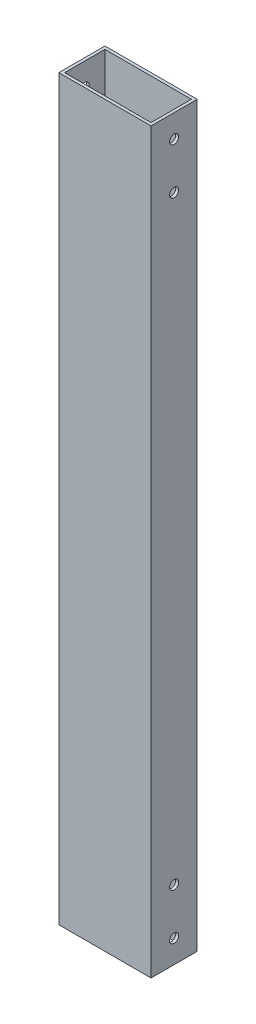
ISO-10303-21;
HEADER;
FILE_DESCRIPTION(('STEP AP214'),'2;1');
FILE_NAME('part.step','',(''),(''),'','','');
FILE_SCHEMA(('AUTOMOTIVE_DESIGN { 1 0 10303 214 1 1 1 1 }'));
ENDSEC;
DATA;
#1=APPLICATION_CONTEXT('core data for automotive mechanical design processes');
#2=APPLICATION_PROTOCOL_DEFINITION('international standard','automotive_design',2000,#1);
#3=PRODUCT_CONTEXT('',#1,'mechanical');
#4=PRODUCT('Part','Part','',(#3));
#5=PRODUCT_RELATED_PRODUCT_CATEGORY('part','',(#4));
#6=PRODUCT_DEFINITION_FORMATION('','',#4);
#7=PRODUCT_DEFINITION_CONTEXT('part definition',#1,'design');
#8=PRODUCT_DEFINITION('design','',#6,#7);
#9=PRODUCT_DEFINITION_SHAPE('','',#8);
#10=(LENGTH_UNIT() NAMED_UNIT(*) SI_UNIT(.MILLI.,.METRE.));
#11=(NAMED_UNIT(*) PLANE_ANGLE_UNIT() SI_UNIT($,.RADIAN.));
#12=(NAMED_UNIT(*) SI_UNIT($,.STERADIAN.) SOLID_ANGLE_UNIT());
#13=UNCERTAINTY_MEASURE_WITH_UNIT(LENGTH_MEASURE(1.E-05),#10,'distance_accuracy_value','');
#14=(GEOMETRIC_REPRESENTATION_CONTEXT(3) GLOBAL_UNCERTAINTY_ASSIGNED_CONTEXT((#13)) GLOBAL_UNIT_ASSIGNED_CONTEXT((#10,
#11,#12)) REPRESENTATION_CONTEXT('',''));
#15=CARTESIAN_POINT('',(0.,0.,0.));
#16=DIRECTION('',(0.,0.,1.));
#17=DIRECTION('',(1.,0.,0.));
#18=AXIS2_PLACEMENT_3D('',#15,#16,#17);
#19=CARTESIAN_POINT('',(0.,12.7,-12.7));
#20=DIRECTION('',(1.,0.,0.));
#21=DIRECTION('',(0.,0.,-1.));
#22=AXIS2_PLACEMENT_3D('',#19,#20,#21);
#23=CYLINDRICAL_SURFACE('',#22,2.4892);
#24=CARTESIAN_POINT('',(1.5875,12.7,-12.7));
#25=DIRECTION('',(-1.,0.,0.));
#26=DIRECTION('',(0.,0.,-1.));
#27=AXIS2_PLACEMENT_3D('',#24,#25,#26);
#28=CIRCLE('',#27,2.4892);
#29=CARTESIAN_POINT('',(1.5875,12.7,-15.1892));
#30=VERTEX_POINT('',#29);
#31=EDGE_CURVE('E217',#30,#30,#28,.T.);
#32=ORIENTED_EDGE('',*,*,#31,.F.);
#33=EDGE_LOOP('',(#32));
#34=FACE_BOUND('',#33,.T.);
#35=CARTESIAN_POINT('',(0.,12.7,-12.7));
#36=DIRECTION('',(-1.,0.,0.));
#37=DIRECTION('',(0.,0.,-1.));
#38=AXIS2_PLACEMENT_3D('',#35,#36,#37);
#39=CIRCLE('',#38,2.4892);
#40=CARTESIAN_POINT('',(0.,12.7,-15.1892));
#41=VERTEX_POINT('',#40);
#42=EDGE_CURVE('E258',#41,#41,#39,.T.);
#43=ORIENTED_EDGE('',*,*,#42,.T.);
#44=EDGE_LOOP('',(#43));
#45=FACE_BOUND('',#44,.T.);
#46=ADVANCED_FACE('F16',(#34,#45),#23,.F.);
#47=CARTESIAN_POINT('',(0.,38.1,-12.7));
#48=DIRECTION('',(1.,0.,0.));
#49=DIRECTION('',(0.,0.,-1.));
#50=AXIS2_PLACEMENT_3D('',#47,#48,#49);
#51=CYLINDRICAL_SURFACE('',#50,2.4892);
#52=CARTESIAN_POINT('',(1.5875,38.1,-12.7));
#53=DIRECTION('',(-1.,0.,0.));
#54=DIRECTION('',(0.,0.,-1.));
#55=AXIS2_PLACEMENT_3D('',#52,#53,#54);
#56=CIRCLE('',#55,2.4892);
#57=CARTESIAN_POINT('',(1.5875,38.1,-15.1892));
#58=VERTEX_POINT('',#57);
#59=EDGE_CURVE('E220',#58,#58,#56,.T.);
#60=ORIENTED_EDGE('',*,*,#59,.F.);
#61=EDGE_LOOP('',(#60));
#62=FACE_BOUND('',#61,.T.);
#63=CARTESIAN_POINT('',(0.,38.1,-12.7));
#64=DIRECTION('',(-1.,0.,0.));
#65=DIRECTION('',(0.,0.,-1.));
#66=AXIS2_PLACEMENT_3D('',#63,#64,#65);
#67=CIRCLE('',#66,2.4892);
#68=CARTESIAN_POINT('',(0.,38.1,-15.1892));
#69=VERTEX_POINT('',#68);
#70=EDGE_CURVE('E216',#69,#69,#67,.T.);
#71=ORIENTED_EDGE('',*,*,#70,.T.);
#72=EDGE_LOOP('',(#71));
#73=FACE_BOUND('',#72,.T.);
#74=ADVANCED_FACE('F481',(#62,#73),#51,.F.);
#75=CARTESIAN_POINT('',(0.,12.7,-12.7));
#76=DIRECTION('',(1.,0.,0.));
#77=DIRECTION('',(0.,0.,-1.));
#78=AXIS2_PLACEMENT_3D('',#75,#76,#77);
#79=CYLINDRICAL_SURFACE('',#78,2.4892);
#80=CARTESIAN_POINT('',(49.2125,12.7,-12.7));
#81=DIRECTION('',(1.,0.,0.));
#82=DIRECTION('',(0.,0.,1.));
#83=AXIS2_PLACEMENT_3D('',#80,#81,#82);
#84=CIRCLE('',#83,2.4892);
#85=CARTESIAN_POINT('',(49.2125,12.7,-10.2108));
#86=VERTEX_POINT('',#85);
#87=EDGE_CURVE('E282',#86,#86,#84,.T.);
#88=ORIENTED_EDGE('',*,*,#87,.F.);
#89=EDGE_LOOP('',(#88));
#90=FACE_BOUND('',#89,.T.);
#91=CARTESIAN_POINT('',(50.8,12.7,-12.7));
#92=DIRECTION('',(-1.,0.,0.));
#93=DIRECTION('',(0.,0.,-1.));
#94=AXIS2_PLACEMENT_3D('',#91,#92,#93);
#95=CIRCLE('',#94,2.4892);
#96=CARTESIAN_POINT('',(50.8,12.7,-15.1892));
#97=VERTEX_POINT('',#96);
#98=EDGE_CURVE('E191',#97,#97,#95,.T.);
#99=ORIENTED_EDGE('',*,*,#98,.F.);
#100=EDGE_LOOP('',(#99));
#101=FACE_BOUND('',#100,.T.);
#102=ADVANCED_FACE('F475',(#90,#101),#79,.F.);
#103=CARTESIAN_POINT('',(0.,38.1,-12.7));
#104=DIRECTION('',(1.,0.,0.));
#105=DIRECTION('',(0.,0.,-1.));
#106=AXIS2_PLACEMENT_3D('',#103,#104,#105);
#107=CYLINDRICAL_SURFACE('',#106,2.4892);
#108=CARTESIAN_POINT('',(49.2125,38.1,-12.7));
#109=DIRECTION('',(1.,0.,0.));
#110=DIRECTION('',(0.,0.,1.));
#111=AXIS2_PLACEMENT_3D('',#108,#109,#110);
#112=CIRCLE('',#111,2.4892);
#113=CARTESIAN_POINT('',(49.2125,38.1,-10.2108));
#114=VERTEX_POINT('',#113);
#115=EDGE_CURVE('E265',#114,#114,#112,.T.);
#116=ORIENTED_EDGE('',*,*,#115,.F.);
#117=EDGE_LOOP('',(#116));
#118=FACE_BOUND('',#117,.T.);
#119=CARTESIAN_POINT('',(50.8,38.1,-12.7));
#120=DIRECTION('',(-1.,0.,0.));
#121=DIRECTION('',(0.,0.,-1.));
#122=AXIS2_PLACEMENT_3D('',#119,#120,#121);
#123=CIRCLE('',#122,2.4892);
#124=CARTESIAN_POINT('',(50.8,38.1,-15.1892));
#125=VERTEX_POINT('',#124);
#126=EDGE_CURVE('E196',#125,#125,#123,.T.);
#127=ORIENTED_EDGE('',*,*,#126,.F.);
#128=EDGE_LOOP('',(#127));
#129=FACE_BOUND('',#128,.T.);
#130=ADVANCED_FACE('F470',(#118,#129),#107,.F.);
#131=CARTESIAN_POINT('',(0.,393.7,-12.7));
#132=DIRECTION('',(1.,0.,0.));
#133=DIRECTION('',(0.,0.,-1.));
#134=AXIS2_PLACEMENT_3D('',#131,#132,#133);
#135=CYLINDRICAL_SURFACE('',#134,2.4892);
#136=CARTESIAN_POINT('',(1.5875,393.7,-12.7));
#137=DIRECTION('',(1.,0.,0.));
#138=DIRECTION('',(0.,0.,-1.));
#139=AXIS2_PLACEMENT_3D('',#136,#137,#138);
#140=CIRCLE('',#139,2.4892);
#141=CARTESIAN_POINT('',(1.5875,393.7,-15.1892));
#142=VERTEX_POINT('',#141);
#143=EDGE_CURVE('E221',#142,#142,#140,.T.);
#144=ORIENTED_EDGE('',*,*,#143,.T.);
#145=EDGE_LOOP('',(#144));
#146=FACE_BOUND('',#145,.T.);
#147=CARTESIAN_POINT('',(0.,393.7,-12.7));
#148=DIRECTION('',(1.,0.,0.));
#149=DIRECTION('',(0.,0.,-1.));
#150=AXIS2_PLACEMENT_3D('',#147,#148,#149);
#151=CIRCLE('',#150,2.4892);
#152=CARTESIAN_POINT('',(0.,393.7,-15.1892));
#153=VERTEX_POINT('',#152);
#154=EDGE_CURVE('E213',#153,#153,#151,.T.);
#155=ORIENTED_EDGE('',*,*,#154,.F.);
#156=EDGE_LOOP('',(#155));
#157=FACE_BOUND('',#156,.T.);
#158=ADVANCED_FACE('F474',(#146,#157),#135,.F.);
#159=CARTESIAN_POINT('',(0.,368.3,-12.7));
#160=DIRECTION('',(1.,0.,0.));
#161=DIRECTION('',(0.,0.,-1.));
#162=AXIS2_PLACEMENT_3D('',#159,#160,#161);
#163=CYLINDRICAL_SURFACE('',#162,2.4892);
#164=CARTESIAN_POINT('',(1.5875,368.3,-12.7));
#165=DIRECTION('',(1.,0.,0.));
#166=DIRECTION('',(0.,0.,-1.));
#167=AXIS2_PLACEMENT_3D('',#164,#165,#166);
#168=CIRCLE('',#167,2.4892);
#169=CARTESIAN_POINT('',(1.5875,368.3,-15.1892));
#170=VERTEX_POINT('',#169);
#171=EDGE_CURVE('E225',#170,#170,#168,.T.);
#172=ORIENTED_EDGE('',*,*,#171,.T.);
#173=EDGE_LOOP('',(#172));
#174=FACE_BOUND('',#173,.T.);
#175=CARTESIAN_POINT('',(0.,368.3,-12.7));
#176=DIRECTION('',(1.,0.,0.));
#177=DIRECTION('',(0.,0.,-1.));
#178=AXIS2_PLACEMENT_3D('',#175,#176,#177);
#179=CIRCLE('',#178,2.4892);
#180=CARTESIAN_POINT('',(0.,368.3,-15.1892));
#181=VERTEX_POINT('',#180);
#182=EDGE_CURVE('E183',#181,#181,#179,.T.);
#183=ORIENTED_EDGE('',*,*,#182,.F.);
#184=EDGE_LOOP('',(#183));
#185=FACE_BOUND('',#184,.T.);
#186=ADVANCED_FACE('F465',(#174,#185),#163,.F.);
#187=CARTESIAN_POINT('',(0.,393.7,-12.7));
#188=DIRECTION('',(1.,0.,0.));
#189=DIRECTION('',(0.,0.,-1.));
#190=AXIS2_PLACEMENT_3D('',#187,#188,#189);
#191=CYLINDRICAL_SURFACE('',#190,2.4892);
#192=CARTESIAN_POINT('',(49.2125,393.7,-12.7));
#193=DIRECTION('',(-1.,0.,0.));
#194=DIRECTION('',(0.,0.,1.));
#195=AXIS2_PLACEMENT_3D('',#192,#193,#194);
#196=CIRCLE('',#195,2.4892);
#197=CARTESIAN_POINT('',(49.2125,393.7,-10.2108));
#198=VERTEX_POINT('',#197);
#199=EDGE_CURVE('E27',#198,#198,#196,.T.);
#200=ORIENTED_EDGE('',*,*,#199,.T.);
#201=EDGE_LOOP('',(#200));
#202=FACE_BOUND('',#201,.T.);
#203=CARTESIAN_POINT('',(50.8,393.7,-12.7));
#204=DIRECTION('',(1.,0.,0.));
#205=DIRECTION('',(0.,0.,-1.));
#206=AXIS2_PLACEMENT_3D('',#203,#204,#205);
#207=CIRCLE('',#206,2.4892);
#208=CARTESIAN_POINT('',(50.8,393.7,-15.1892));
#209=VERTEX_POINT('',#208);
#210=EDGE_CURVE('E204',#209,#209,#207,.T.);
#211=ORIENTED_EDGE('',*,*,#210,.T.);
#212=EDGE_LOOP('',(#211));
#213=FACE_BOUND('',#212,.T.);
#214=ADVANCED_FACE('F460',(#202,#213),#191,.F.);
#215=CARTESIAN_POINT('',(0.,368.3,-12.7));
#216=DIRECTION('',(1.,0.,0.));
#217=DIRECTION('',(0.,0.,-1.));
#218=AXIS2_PLACEMENT_3D('',#215,#216,#217);
#219=CYLINDRICAL_SURFACE('',#218,2.4892);
#220=CARTESIAN_POINT('',(49.2125,368.3,-12.7));
#221=DIRECTION('',(-1.,0.,0.));
#222=DIRECTION('',(0.,0.,1.));
#223=AXIS2_PLACEMENT_3D('',#220,#221,#222);
#224=CIRCLE('',#223,2.4892);
#225=CARTESIAN_POINT('',(49.2125,368.3,-10.2108));
#226=VERTEX_POINT('',#225);
#227=EDGE_CURVE('E11',#226,#226,#224,.T.);
#228=ORIENTED_EDGE('',*,*,#227,.T.);
#229=EDGE_LOOP('',(#228));
#230=FACE_BOUND('',#229,.T.);
#231=CARTESIAN_POINT('',(50.8,368.3,-12.7));
#232=DIRECTION('',(1.,0.,0.));
#233=DIRECTION('',(0.,0.,-1.));
#234=AXIS2_PLACEMENT_3D('',#231,#232,#233);
#235=CIRCLE('',#234,2.4892);
#236=CARTESIAN_POINT('',(50.8,368.3,-15.1892));
#237=VERTEX_POINT('',#236);
#238=EDGE_CURVE('E254',#237,#237,#235,.T.);
#239=ORIENTED_EDGE('',*,*,#238,.T.);
#240=EDGE_LOOP('',(#239));
#241=FACE_BOUND('',#240,.T.);
#242=ADVANCED_FACE('F464',(#230,#241),#219,.F.);
#243=CARTESIAN_POINT('',(1.5875,406.4,-23.8125));
#244=DIRECTION('',(0.,0.,1.));
#245=DIRECTION('',(1.,0.,0.));
#246=AXIS2_PLACEMENT_3D('',#243,#244,#245);
#247=PLANE('',#246);
#248=DIRECTION('',(-1.,0.,0.));
#249=VECTOR('',#248,1.);
#250=CARTESIAN_POINT('',(1.5875,0.,-23.8125));
#251=LINE('',#250,#249);
#252=CARTESIAN_POINT('',(49.2125,0.,-23.8125));
#253=VERTEX_POINT('',#252);
#254=CARTESIAN_POINT('',(1.5875,0.,-23.8125));
#255=VERTEX_POINT('',#254);
#256=EDGE_CURVE('E229',#253,#255,#251,.T.);
#257=ORIENTED_EDGE('',*,*,#256,.F.);
#258=DIRECTION('',(0.,-1.,0.));
#259=VECTOR('',#258,1.);
#260=CARTESIAN_POINT('',(49.2125,406.4,-23.8125));
#261=LINE('',#260,#259);
#262=CARTESIAN_POINT('',(49.2125,406.4,-23.8125));
#263=VERTEX_POINT('',#262);
#264=EDGE_CURVE('E298',#263,#253,#261,.T.);
#265=ORIENTED_EDGE('',*,*,#264,.F.);
#266=DIRECTION('',(-1.,0.,0.));
#267=VECTOR('',#266,1.);
#268=CARTESIAN_POINT('',(1.5875,406.4,-23.8125));
#269=LINE('',#268,#267);
#270=CARTESIAN_POINT('',(1.5875,406.4,-23.8125));
#271=VERTEX_POINT('',#270);
#272=EDGE_CURVE('E274',#263,#271,#269,.T.);
#273=ORIENTED_EDGE('',*,*,#272,.T.);
#274=DIRECTION('',(0.,-1.,0.));
#275=VECTOR('',#274,1.);
#276=CARTESIAN_POINT('',(1.5875,406.4,-23.8125));
#277=LINE('',#276,#275);
#278=EDGE_CURVE('E257',#271,#255,#277,.T.);
#279=ORIENTED_EDGE('',*,*,#278,.T.);
#280=EDGE_LOOP('',(#257,#265,#273,#279));
#281=FACE_BOUND('',#280,.T.);
#282=ADVANCED_FACE('F527',(#281),#247,.T.);
#283=CARTESIAN_POINT('',(49.2125,406.4,-1.5875));
#284=DIRECTION('',(-1.,0.,0.));
#285=DIRECTION('',(0.,0.,1.));
#286=AXIS2_PLACEMENT_3D('',#283,#284,#285);
#287=PLANE('',#286);
#288=ORIENTED_EDGE('',*,*,#227,.F.);
#289=EDGE_LOOP('',(#288));
#290=FACE_BOUND('',#289,.T.);
#291=ORIENTED_EDGE('',*,*,#199,.F.);
#292=EDGE_LOOP('',(#291));
#293=FACE_BOUND('',#292,.T.);
#294=ORIENTED_EDGE('',*,*,#115,.T.);
#295=EDGE_LOOP('',(#294));
#296=FACE_BOUND('',#295,.T.);
#297=ORIENTED_EDGE('',*,*,#87,.T.);
#298=EDGE_LOOP('',(#297));
#299=FACE_BOUND('',#298,.T.);
#300=DIRECTION('',(0.,0.,-1.));
#301=VECTOR('',#300,1.);
#302=CARTESIAN_POINT('',(49.2125,0.,-1.5875));
#303=LINE('',#302,#301);
#304=CARTESIAN_POINT('',(49.2125,0.,-1.5875));
#305=VERTEX_POINT('',#304);
#306=EDGE_CURVE('E227',#305,#253,#303,.T.);
#307=ORIENTED_EDGE('',*,*,#306,.F.);
#308=DIRECTION('',(0.,-1.,0.));
#309=VECTOR('',#308,1.);
#310=CARTESIAN_POINT('',(49.2125,406.4,-1.5875));
#311=LINE('',#310,#309);
#312=CARTESIAN_POINT('',(49.2125,406.4,-1.5875));
#313=VERTEX_POINT('',#312);
#314=EDGE_CURVE('E109',#313,#305,#311,.T.);
#315=ORIENTED_EDGE('',*,*,#314,.F.);
#316=DIRECTION('',(0.,0.,-1.));
#317=VECTOR('',#316,1.);
#318=CARTESIAN_POINT('',(49.2125,406.4,-1.5875));
#319=LINE('',#318,#317);
#320=EDGE_CURVE('E270',#313,#263,#319,.T.);
#321=ORIENTED_EDGE('',*,*,#320,.T.);
#322=ORIENTED_EDGE('',*,*,#264,.T.);
#323=EDGE_LOOP('',(#307,#315,#321,#322));
#324=FACE_BOUND('',#323,.T.);
#325=ADVANCED_FACE('F523',(#290,#293,#296,#299,#324),#287,.T.);
#326=CARTESIAN_POINT('',(1.5875,406.4,-1.5875));
#327=DIRECTION('',(0.,0.,-1.));
#328=DIRECTION('',(0.,-1.,0.));
#329=AXIS2_PLACEMENT_3D('',#326,#327,#328);
#330=PLANE('',#329);
#331=DIRECTION('',(1.,0.,0.));
#332=VECTOR('',#331,1.);
#333=CARTESIAN_POINT('',(1.5875,0.,-1.5875));
#334=LINE('',#333,#332);
#335=CARTESIAN_POINT('',(1.5875,0.,-1.5875));
#336=VERTEX_POINT('',#335);
#337=EDGE_CURVE('E245',#336,#305,#334,.T.);
#338=ORIENTED_EDGE('',*,*,#337,.F.);
#339=DIRECTION('',(0.,-1.,0.));
#340=VECTOR('',#339,1.);
#341=CARTESIAN_POINT('',(1.5875,406.4,-1.5875));
#342=LINE('',#341,#340);
#343=CARTESIAN_POINT('',(1.5875,406.4,-1.5875));
#344=VERTEX_POINT('',#343);
#345=EDGE_CURVE('E125',#344,#336,#342,.T.);
#346=ORIENTED_EDGE('',*,*,#345,.F.);
#347=DIRECTION('',(1.,0.,0.));
#348=VECTOR('',#347,1.);
#349=CARTESIAN_POINT('',(1.5875,406.4,-1.5875));
#350=LINE('',#349,#348);
#351=EDGE_CURVE('E209',#344,#313,#350,.T.);
#352=ORIENTED_EDGE('',*,*,#351,.T.);
#353=ORIENTED_EDGE('',*,*,#314,.T.);
#354=EDGE_LOOP('',(#338,#346,#352,#353));
#355=FACE_BOUND('',#354,.T.);
#356=ADVANCED_FACE('F502',(#355),#330,.T.);
#357=CARTESIAN_POINT('',(1.5875,406.4,-1.5875));
#358=DIRECTION('',(1.,0.,0.));
#359=DIRECTION('',(0.,1.,0.));
#360=AXIS2_PLACEMENT_3D('',#357,#358,#359);
#361=PLANE('',#360);
#362=ORIENTED_EDGE('',*,*,#171,.F.);
#363=EDGE_LOOP('',(#362));
#364=FACE_BOUND('',#363,.T.);
#365=ORIENTED_EDGE('',*,*,#143,.F.);
#366=EDGE_LOOP('',(#365));
#367=FACE_BOUND('',#366,.T.);
#368=ORIENTED_EDGE('',*,*,#59,.T.);
#369=EDGE_LOOP('',(#368));
#370=FACE_BOUND('',#369,.T.);
#371=ORIENTED_EDGE('',*,*,#31,.T.);
#372=EDGE_LOOP('',(#371));
#373=FACE_BOUND('',#372,.T.);
#374=DIRECTION('',(0.,0.,1.));
#375=VECTOR('',#374,1.);
#376=CARTESIAN_POINT('',(1.5875,0.,-1.5875));
#377=LINE('',#376,#375);
#378=EDGE_CURVE('E233',#255,#336,#377,.T.);
#379=ORIENTED_EDGE('',*,*,#378,.F.);
#380=ORIENTED_EDGE('',*,*,#278,.F.);
#381=DIRECTION('',(0.,0.,1.));
#382=VECTOR('',#381,1.);
#383=CARTESIAN_POINT('',(1.5875,406.4,-1.5875));
#384=LINE('',#383,#382);
#385=EDGE_CURVE('E269',#271,#344,#384,.T.);
#386=ORIENTED_EDGE('',*,*,#385,.T.);
#387=ORIENTED_EDGE('',*,*,#345,.T.);
#388=EDGE_LOOP('',(#379,#380,#386,#387));
#389=FACE_BOUND('',#388,.T.);
#390=ADVANCED_FACE('F498',(#364,#367,#370,#373,#389),#361,.T.);
#391=CARTESIAN_POINT('',(0.,406.4,-25.4));
#392=DIRECTION('',(0.,0.,1.));
#393=DIRECTION('',(1.,0.,0.));
#394=AXIS2_PLACEMENT_3D('',#391,#392,#393);
#395=PLANE('',#394);
#396=DIRECTION('',(-1.,0.,0.));
#397=VECTOR('',#396,1.);
#398=CARTESIAN_POINT('',(0.,0.,-25.4));
#399=LINE('',#398,#397);
#400=CARTESIAN_POINT('',(50.8,0.,-25.4));
#401=VERTEX_POINT('',#400);
#402=CARTESIAN_POINT('',(0.,0.,-25.4));
#403=VERTEX_POINT('',#402);
#404=EDGE_CURVE('E237',#401,#403,#399,.T.);
#405=ORIENTED_EDGE('',*,*,#404,.T.);
#406=DIRECTION('',(0.,-1.,0.));
#407=VECTOR('',#406,1.);
#408=CARTESIAN_POINT('',(0.,406.4,-25.4));
#409=LINE('',#408,#407);
#410=CARTESIAN_POINT('',(0.,406.4,-25.4));
#411=VERTEX_POINT('',#410);
#412=EDGE_CURVE('E95',#411,#403,#409,.T.);
#413=ORIENTED_EDGE('',*,*,#412,.F.);
#414=DIRECTION('',(-1.,0.,0.));
#415=VECTOR('',#414,1.);
#416=CARTESIAN_POINT('',(0.,406.4,-25.4));
#417=LINE('',#416,#415);
#418=CARTESIAN_POINT('',(50.8,406.4,-25.4));
#419=VERTEX_POINT('',#418);
#420=EDGE_CURVE('E250',#419,#411,#417,.T.);
#421=ORIENTED_EDGE('',*,*,#420,.F.);
#422=DIRECTION('',(0.,-1.,0.));
#423=VECTOR('',#422,1.);
#424=CARTESIAN_POINT('',(50.8,406.4,-25.4));
#425=LINE('',#424,#423);
#426=EDGE_CURVE('E197',#419,#401,#425,.T.);
#427=ORIENTED_EDGE('',*,*,#426,.T.);
#428=EDGE_LOOP('',(#405,#413,#421,#427));
#429=FACE_BOUND('',#428,.T.);
#430=ADVANCED_FACE('F324',(#429),#395,.F.);
#431=CARTESIAN_POINT('',(50.8,406.4,0.));
#432=DIRECTION('',(-1.,0.,0.));
#433=DIRECTION('',(0.,0.,1.));
#434=AXIS2_PLACEMENT_3D('',#431,#432,#433);
#435=PLANE('',#434);
#436=ORIENTED_EDGE('',*,*,#238,.F.);
#437=EDGE_LOOP('',(#436));
#438=FACE_BOUND('',#437,.T.);
#439=ORIENTED_EDGE('',*,*,#210,.F.);
#440=EDGE_LOOP('',(#439));
#441=FACE_BOUND('',#440,.T.);
#442=ORIENTED_EDGE('',*,*,#126,.T.);
#443=EDGE_LOOP('',(#442));
#444=FACE_BOUND('',#443,.T.);
#445=ORIENTED_EDGE('',*,*,#98,.T.);
#446=EDGE_LOOP('',(#445));
#447=FACE_BOUND('',#446,.T.);
#448=DIRECTION('',(0.,0.,-1.));
#449=VECTOR('',#448,1.);
#450=CARTESIAN_POINT('',(50.8,0.,0.));
#451=LINE('',#450,#449);
#452=CARTESIAN_POINT('',(50.8,0.,0.));
#453=VERTEX_POINT('',#452);
#454=EDGE_CURVE('E238',#453,#401,#451,.T.);
#455=ORIENTED_EDGE('',*,*,#454,.T.);
#456=ORIENTED_EDGE('',*,*,#426,.F.);
#457=DIRECTION('',(0.,0.,-1.));
#458=VECTOR('',#457,1.);
#459=CARTESIAN_POINT('',(50.8,406.4,0.));
#460=LINE('',#459,#458);
#461=CARTESIAN_POINT('',(50.8,406.4,0.));
#462=VERTEX_POINT('',#461);
#463=EDGE_CURVE('E246',#462,#419,#460,.T.);
#464=ORIENTED_EDGE('',*,*,#463,.F.);
#465=DIRECTION('',(0.,-1.,0.));
#466=VECTOR('',#465,1.);
#467=CARTESIAN_POINT('',(50.8,406.4,0.));
#468=LINE('',#467,#466);
#469=EDGE_CURVE('E205',#462,#453,#468,.T.);
#470=ORIENTED_EDGE('',*,*,#469,.T.);
#471=EDGE_LOOP('',(#455,#456,#464,#470));
#472=FACE_BOUND('',#471,.T.);
#473=ADVANCED_FACE('F192',(#438,#441,#444,#447,#472),#435,.F.);
#474=CARTESIAN_POINT('',(0.,406.4,0.));
#475=DIRECTION('',(0.,0.,-1.));
#476=DIRECTION('',(0.,-1.,0.));
#477=AXIS2_PLACEMENT_3D('',#474,#475,#476);
#478=PLANE('',#477);
#479=DIRECTION('',(1.,0.,0.));
#480=VECTOR('',#479,1.);
#481=CARTESIAN_POINT('',(0.,0.,0.));
#482=LINE('',#481,#480);
#483=CARTESIAN_POINT('',(0.,0.,0.));
#484=VERTEX_POINT('',#483);
#485=EDGE_CURVE('E20',#484,#453,#482,.T.);
#486=ORIENTED_EDGE('',*,*,#485,.T.);
#487=ORIENTED_EDGE('',*,*,#469,.F.);
#488=DIRECTION('',(1.,0.,0.));
#489=VECTOR('',#488,1.);
#490=CARTESIAN_POINT('',(0.,406.4,0.));
#491=LINE('',#490,#489);
#492=CARTESIAN_POINT('',(0.,406.4,0.));
#493=VERTEX_POINT('',#492);
#494=EDGE_CURVE('E251',#493,#462,#491,.T.);
#495=ORIENTED_EDGE('',*,*,#494,.F.);
#496=DIRECTION('',(0.,-1.,0.));
#497=VECTOR('',#496,1.);
#498=CARTESIAN_POINT('',(0.,406.4,0.));
#499=LINE('',#498,#497);
#500=EDGE_CURVE('E81',#493,#484,#499,.T.);
#501=ORIENTED_EDGE('',*,*,#500,.T.);
#502=EDGE_LOOP('',(#486,#487,#495,#501));
#503=FACE_BOUND('',#502,.T.);
#504=ADVANCED_FACE('F319',(#503),#478,.F.);
#505=CARTESIAN_POINT('',(0.,406.4,0.));
#506=DIRECTION('',(1.,0.,0.));
#507=DIRECTION('',(0.,1.,0.));
#508=AXIS2_PLACEMENT_3D('',#505,#506,#507);
#509=PLANE('',#508);
#510=ORIENTED_EDGE('',*,*,#182,.T.);
#511=EDGE_LOOP('',(#510));
#512=FACE_BOUND('',#511,.T.);
#513=ORIENTED_EDGE('',*,*,#154,.T.);
#514=EDGE_LOOP('',(#513));
#515=FACE_BOUND('',#514,.T.);
#516=ORIENTED_EDGE('',*,*,#70,.F.);
#517=EDGE_LOOP('',(#516));
#518=FACE_BOUND('',#517,.T.);
#519=ORIENTED_EDGE('',*,*,#42,.F.);
#520=EDGE_LOOP('',(#519));
#521=FACE_BOUND('',#520,.T.);
#522=DIRECTION('',(0.,0.,1.));
#523=VECTOR('',#522,1.);
#524=CARTESIAN_POINT('',(0.,0.,0.));
#525=LINE('',#524,#523);
#526=EDGE_CURVE('E234',#403,#484,#525,.T.);
#527=ORIENTED_EDGE('',*,*,#526,.T.);
#528=ORIENTED_EDGE('',*,*,#500,.F.);
#529=DIRECTION('',(0.,0.,1.));
#530=VECTOR('',#529,1.);
#531=CARTESIAN_POINT('',(0.,406.4,0.));
#532=LINE('',#531,#530);
#533=EDGE_CURVE('E297',#411,#493,#532,.T.);
#534=ORIENTED_EDGE('',*,*,#533,.F.);
#535=ORIENTED_EDGE('',*,*,#412,.T.);
#536=EDGE_LOOP('',(#527,#528,#534,#535));
#537=FACE_BOUND('',#536,.T.);
#538=ADVANCED_FACE('F455',(#512,#515,#518,#521,#537),#509,.F.);
#539=CARTESIAN_POINT('',(0.,0.,0.));
#540=DIRECTION('',(0.,-1.,0.));
#541=DIRECTION('',(0.,0.,-1.));
#542=AXIS2_PLACEMENT_3D('',#539,#540,#541);
#543=PLANE('',#542);
#544=ORIENTED_EDGE('',*,*,#256,.T.);
#545=ORIENTED_EDGE('',*,*,#378,.T.);
#546=ORIENTED_EDGE('',*,*,#337,.T.);
#547=ORIENTED_EDGE('',*,*,#306,.T.);
#548=EDGE_LOOP('',(#544,#545,#546,#547));
#549=FACE_BOUND('',#548,.T.);
#550=ORIENTED_EDGE('',*,*,#526,.F.);
#551=ORIENTED_EDGE('',*,*,#404,.F.);
#552=ORIENTED_EDGE('',*,*,#454,.F.);
#553=ORIENTED_EDGE('',*,*,#485,.F.);
#554=EDGE_LOOP('',(#550,#551,#552,#553));
#555=FACE_BOUND('',#554,.T.);
#556=ADVANCED_FACE('F18',(#549,#555),#543,.T.);
#557=CARTESIAN_POINT('',(0.,406.4,0.));
#558=DIRECTION('',(0.,-1.,0.));
#559=DIRECTION('',(0.,0.,-1.));
#560=AXIS2_PLACEMENT_3D('',#557,#558,#559);
#561=PLANE('',#560);
#562=ORIENTED_EDGE('',*,*,#385,.F.);
#563=ORIENTED_EDGE('',*,*,#272,.F.);
#564=ORIENTED_EDGE('',*,*,#320,.F.);
#565=ORIENTED_EDGE('',*,*,#351,.F.);
#566=EDGE_LOOP('',(#562,#563,#564,#565));
#567=FACE_BOUND('',#566,.T.);
#568=ORIENTED_EDGE('',*,*,#533,.T.);
#569=ORIENTED_EDGE('',*,*,#494,.T.);
#570=ORIENTED_EDGE('',*,*,#463,.T.);
#571=ORIENTED_EDGE('',*,*,#420,.T.);
#572=EDGE_LOOP('',(#568,#569,#570,#571));
#573=FACE_BOUND('',#572,.T.);
#574=ADVANCED_FACE('F454',(#567,#573),#561,.F.);
#575=CLOSED_SHELL('',(#46,#74,#102,#130,#158,#186,#214,#242,#282,#325,#356,#390,#430,#473,#504,
#538,#556,#574));
#576=MANIFOLD_SOLID_BREP('B1',#575);
#577=ADVANCED_BREP_SHAPE_REPRESENTATION('',(#18,#576),#14);
#578=SHAPE_DEFINITION_REPRESENTATION(#9,#577);
ENDSEC;
END-ISO-10303-21;
